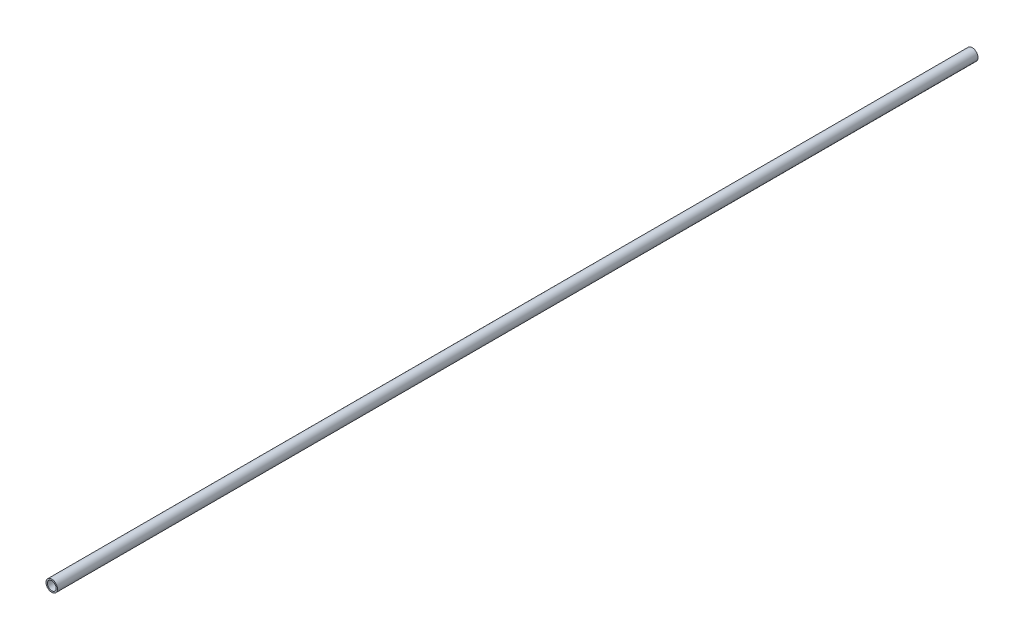
ISO-10303-21;
HEADER;
FILE_DESCRIPTION(('STEP AP214'),'2;1');
FILE_NAME('part.step','',(''),(''),'','','');
FILE_SCHEMA(('AUTOMOTIVE_DESIGN { 1 0 10303 214 1 1 1 1 }'));
ENDSEC;
DATA;
#1=APPLICATION_CONTEXT('core data for automotive mechanical design processes');
#2=APPLICATION_PROTOCOL_DEFINITION('international standard','automotive_design',2000,#1);
#3=PRODUCT_CONTEXT('',#1,'mechanical');
#4=PRODUCT('Part','Part','',(#3));
#5=PRODUCT_RELATED_PRODUCT_CATEGORY('part','',(#4));
#6=PRODUCT_DEFINITION_FORMATION('','',#4);
#7=PRODUCT_DEFINITION_CONTEXT('part definition',#1,'design');
#8=PRODUCT_DEFINITION('design','',#6,#7);
#9=PRODUCT_DEFINITION_SHAPE('','',#8);
#10=(LENGTH_UNIT() NAMED_UNIT(*) SI_UNIT(.MILLI.,.METRE.));
#11=(NAMED_UNIT(*) PLANE_ANGLE_UNIT() SI_UNIT($,.RADIAN.));
#12=(NAMED_UNIT(*) SI_UNIT($,.STERADIAN.) SOLID_ANGLE_UNIT());
#13=UNCERTAINTY_MEASURE_WITH_UNIT(LENGTH_MEASURE(1.E-05),#10,'distance_accuracy_value','');
#14=(GEOMETRIC_REPRESENTATION_CONTEXT(3) GLOBAL_UNCERTAINTY_ASSIGNED_CONTEXT((#13)) GLOBAL_UNIT_ASSIGNED_CONTEXT((#10,
#11,#12)) REPRESENTATION_CONTEXT('',''));
#15=CARTESIAN_POINT('',(0.,0.,0.));
#16=DIRECTION('',(0.,0.,1.));
#17=DIRECTION('',(1.,0.,0.));
#18=AXIS2_PLACEMENT_3D('',#15,#16,#17);
#19=CARTESIAN_POINT('',(0.,0.,-3.));
#20=DIRECTION('',(0.,0.,1.));
#21=DIRECTION('',(1.,0.,0.));
#22=AXIS2_PLACEMENT_3D('',#19,#20,#21);
#23=CYLINDRICAL_SURFACE('',#22,12.5);
#24=CARTESIAN_POINT('',(0.,0.,-3.));
#25=DIRECTION('',(0.,0.,1.));
#26=DIRECTION('',(1.,0.,0.));
#27=AXIS2_PLACEMENT_3D('',#24,#25,#26);
#28=CIRCLE('',#27,12.5);
#29=CARTESIAN_POINT('',(12.5,0.,-3.));
#30=VERTEX_POINT('',#29);
#31=EDGE_CURVE('E10',#30,#30,#28,.T.);
#32=ORIENTED_EDGE('',*,*,#31,.T.);
#33=EDGE_LOOP('',(#32));
#34=FACE_BOUND('',#33,.T.);
#35=CARTESIAN_POINT('',(0.,0.,2000.));
#36=DIRECTION('',(0.,0.,1.));
#37=DIRECTION('',(1.,0.,0.));
#38=AXIS2_PLACEMENT_3D('',#35,#36,#37);
#39=CIRCLE('',#38,12.5);
#40=CARTESIAN_POINT('',(12.5,0.,2000.));
#41=VERTEX_POINT('',#40);
#42=EDGE_CURVE('E48',#41,#41,#39,.T.);
#43=ORIENTED_EDGE('',*,*,#42,.F.);
#44=EDGE_LOOP('',(#43));
#45=FACE_BOUND('',#44,.T.);
#46=ADVANCED_FACE('F38',(#34,#45),#23,.T.);
#47=CARTESIAN_POINT('',(0.,0.,-3.));
#48=DIRECTION('',(0.,0.,1.));
#49=DIRECTION('',(1.,0.,0.));
#50=AXIS2_PLACEMENT_3D('',#47,#48,#49);
#51=PLANE('',#50);
#52=CARTESIAN_POINT('',(0.,0.,-3.));
#53=DIRECTION('',(0.,0.,1.));
#54=DIRECTION('',(1.,0.,0.));
#55=AXIS2_PLACEMENT_3D('',#52,#53,#54);
#56=CIRCLE('',#55,9.5);
#57=CARTESIAN_POINT('',(9.5,0.,-3.));
#58=VERTEX_POINT('',#57);
#59=EDGE_CURVE('E44',#58,#58,#56,.T.);
#60=ORIENTED_EDGE('',*,*,#59,.T.);
#61=EDGE_LOOP('',(#60));
#62=FACE_BOUND('',#61,.T.);
#63=ORIENTED_EDGE('',*,*,#31,.F.);
#64=EDGE_LOOP('',(#63));
#65=FACE_BOUND('',#64,.T.);
#66=ADVANCED_FACE('F67',(#62,#65),#51,.F.);
#67=CARTESIAN_POINT('',(0.,0.,-3.));
#68=DIRECTION('',(0.,0.,1.));
#69=DIRECTION('',(1.,0.,0.));
#70=AXIS2_PLACEMENT_3D('',#67,#68,#69);
#71=CYLINDRICAL_SURFACE('',#70,9.5);
#72=ORIENTED_EDGE('',*,*,#59,.F.);
#73=EDGE_LOOP('',(#72));
#74=FACE_BOUND('',#73,.T.);
#75=CARTESIAN_POINT('',(0.,0.,2000.));
#76=DIRECTION('',(0.,0.,1.));
#77=DIRECTION('',(1.,0.,0.));
#78=AXIS2_PLACEMENT_3D('',#75,#76,#77);
#79=CIRCLE('',#78,9.5);
#80=CARTESIAN_POINT('',(9.5,0.,2000.));
#81=VERTEX_POINT('',#80);
#82=EDGE_CURVE('E52',#81,#81,#79,.T.);
#83=ORIENTED_EDGE('',*,*,#82,.T.);
#84=EDGE_LOOP('',(#83));
#85=FACE_BOUND('',#84,.T.);
#86=ADVANCED_FACE('F58',(#74,#85),#71,.F.);
#87=CARTESIAN_POINT('',(0.,0.,2000.));
#88=DIRECTION('',(0.,0.,1.));
#89=DIRECTION('',(1.,0.,0.));
#90=AXIS2_PLACEMENT_3D('',#87,#88,#89);
#91=PLANE('',#90);
#92=ORIENTED_EDGE('',*,*,#42,.T.);
#93=EDGE_LOOP('',(#92));
#94=FACE_BOUND('',#93,.T.);
#95=ORIENTED_EDGE('',*,*,#82,.F.);
#96=EDGE_LOOP('',(#95));
#97=FACE_BOUND('',#96,.T.);
#98=ADVANCED_FACE('F60',(#94,#97),#91,.T.);
#99=CLOSED_SHELL('',(#46,#66,#86,#98));
#100=MANIFOLD_SOLID_BREP('B2',#99);
#101=ADVANCED_BREP_SHAPE_REPRESENTATION('',(#18,#100),#14);
#102=SHAPE_DEFINITION_REPRESENTATION(#9,#101);
ENDSEC;
END-ISO-10303-21;
